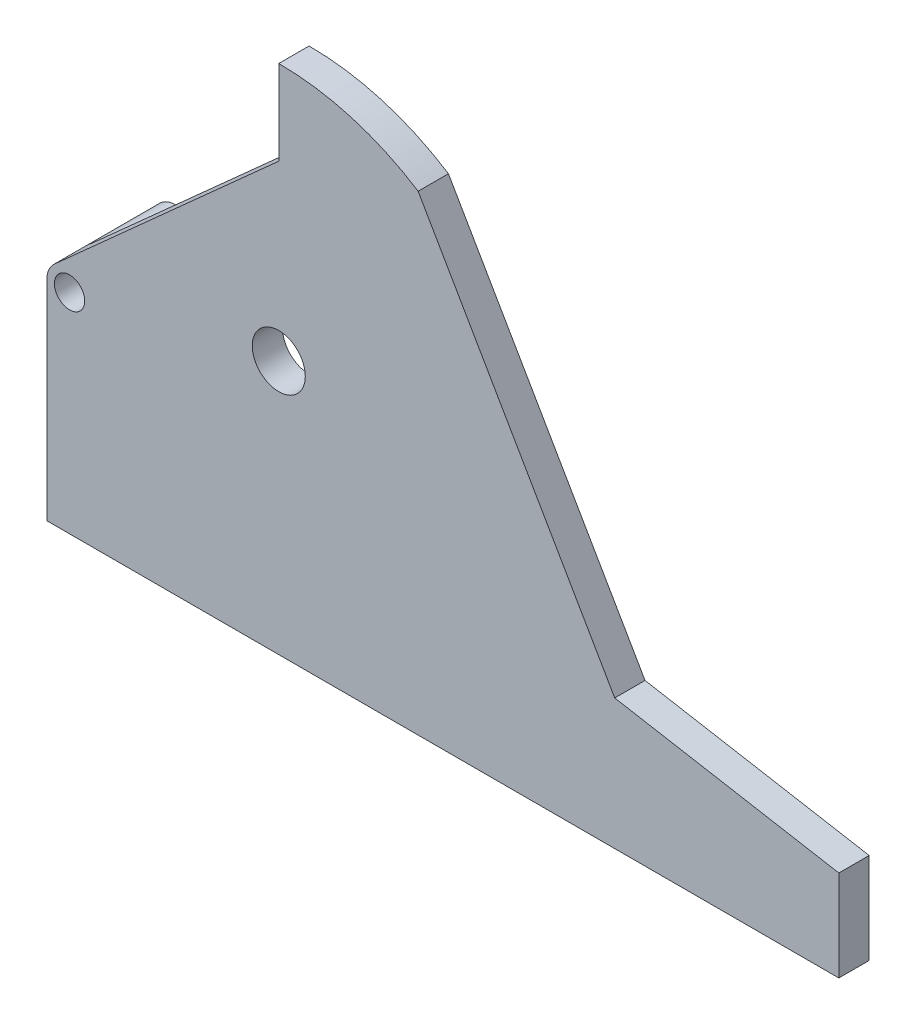
ISO-10303-21;
HEADER;
FILE_DESCRIPTION(('STEP AP214'),'2;1');
FILE_NAME('part.step','',(''),(''),'','','');
FILE_SCHEMA(('AUTOMOTIVE_DESIGN { 1 0 10303 214 1 1 1 1 }'));
ENDSEC;
DATA;
#1=APPLICATION_CONTEXT('core data for automotive mechanical design processes');
#2=APPLICATION_PROTOCOL_DEFINITION('international standard','automotive_design',2000,#1);
#3=PRODUCT_CONTEXT('',#1,'mechanical');
#4=PRODUCT('Part','Part','',(#3));
#5=PRODUCT_RELATED_PRODUCT_CATEGORY('part','',(#4));
#6=PRODUCT_DEFINITION_FORMATION('','',#4);
#7=PRODUCT_DEFINITION_CONTEXT('part definition',#1,'design');
#8=PRODUCT_DEFINITION('design','',#6,#7);
#9=PRODUCT_DEFINITION_SHAPE('','',#8);
#10=(LENGTH_UNIT() NAMED_UNIT(*) SI_UNIT(.MILLI.,.METRE.));
#11=(NAMED_UNIT(*) PLANE_ANGLE_UNIT() SI_UNIT($,.RADIAN.));
#12=(NAMED_UNIT(*) SI_UNIT($,.STERADIAN.) SOLID_ANGLE_UNIT());
#13=UNCERTAINTY_MEASURE_WITH_UNIT(LENGTH_MEASURE(1.E-05),#10,'distance_accuracy_value','');
#14=(GEOMETRIC_REPRESENTATION_CONTEXT(3) GLOBAL_UNCERTAINTY_ASSIGNED_CONTEXT((#13)) GLOBAL_UNIT_ASSIGNED_CONTEXT((#10,
#11,#12)) REPRESENTATION_CONTEXT('',''));
#15=CARTESIAN_POINT('',(0.,0.,0.));
#16=DIRECTION('',(0.,0.,1.));
#17=DIRECTION('',(1.,0.,0.));
#18=AXIS2_PLACEMENT_3D('',#15,#16,#17);
#19=CARTESIAN_POINT('',(153.,167.740187298071,20.));
#20=DIRECTION('',(0.,0.,-1.));
#21=DIRECTION('',(-1.,0.,0.));
#22=AXIS2_PLACEMENT_3D('',#19,#20,#21);
#23=CYLINDRICAL_SURFACE('',#22,170.);
#24=CARTESIAN_POINT('',(153.,167.740187298071,0.));
#25=DIRECTION('',(0.,0.,1.));
#26=DIRECTION('',(1.,0.,0.));
#27=AXIS2_PLACEMENT_3D('',#24,#25,#26);
#28=CIRCLE('',#27,170.);
#29=CARTESIAN_POINT('',(244.94,310.733321398979,0.));
#30=VERTEX_POINT('',#29);
#31=CARTESIAN_POINT('',(153.,337.740187298071,0.));
#32=VERTEX_POINT('',#31);
#33=EDGE_CURVE('E280',#30,#32,#28,.T.);
#34=ORIENTED_EDGE('',*,*,#33,.T.);
#35=DIRECTION('',(0.,0.,-1.));
#36=VECTOR('',#35,1.);
#37=CARTESIAN_POINT('',(153.,337.740187298071,20.));
#38=LINE('',#37,#36);
#39=CARTESIAN_POINT('',(153.,337.740187298071,20.));
#40=VERTEX_POINT('',#39);
#41=EDGE_CURVE('E118',#40,#32,#38,.T.);
#42=ORIENTED_EDGE('',*,*,#41,.F.);
#43=CARTESIAN_POINT('',(153.,167.740187298071,20.));
#44=DIRECTION('',(0.,0.,1.));
#45=DIRECTION('',(1.,0.,0.));
#46=AXIS2_PLACEMENT_3D('',#43,#44,#45);
#47=CIRCLE('',#46,170.);
#48=CARTESIAN_POINT('',(244.94,310.733321398979,20.));
#49=VERTEX_POINT('',#48);
#50=EDGE_CURVE('E259',#49,#40,#47,.T.);
#51=ORIENTED_EDGE('',*,*,#50,.F.);
#52=DIRECTION('',(0.,0.,-1.));
#53=VECTOR('',#52,1.);
#54=CARTESIAN_POINT('',(244.94,310.733321398979,20.));
#55=LINE('',#54,#53);
#56=EDGE_CURVE('E12',#49,#30,#55,.T.);
#57=ORIENTED_EDGE('',*,*,#56,.T.);
#58=EDGE_LOOP('',(#34,#42,#51,#57));
#59=FACE_BOUND('',#58,.T.);
#60=ADVANCED_FACE('F107',(#59),#23,.T.);
#61=CARTESIAN_POINT('',(153.,0.,20.));
#62=DIRECTION('',(-1.,0.,0.));
#63=DIRECTION('',(0.,0.,1.));
#64=AXIS2_PLACEMENT_3D('',#61,#62,#63);
#65=PLANE('',#64);
#66=DIRECTION('',(0.,1.,0.));
#67=VECTOR('',#66,1.);
#68=CARTESIAN_POINT('',(153.,0.,0.));
#69=LINE('',#68,#67);
#70=CARTESIAN_POINT('',(153.,281.918848090833,0.));
#71=VERTEX_POINT('',#70);
#72=EDGE_CURVE('E284',#71,#32,#69,.T.);
#73=ORIENTED_EDGE('',*,*,#72,.F.);
#74=DIRECTION('',(0.,0.,-1.));
#75=VECTOR('',#74,1.);
#76=CARTESIAN_POINT('',(153.,281.918848090833,20.));
#77=LINE('',#76,#75);
#78=CARTESIAN_POINT('',(153.,281.918848090833,20.));
#79=VERTEX_POINT('',#78);
#80=EDGE_CURVE('E228',#79,#71,#77,.T.);
#81=ORIENTED_EDGE('',*,*,#80,.F.);
#82=DIRECTION('',(0.,1.,0.));
#83=VECTOR('',#82,1.);
#84=CARTESIAN_POINT('',(153.,0.,20.));
#85=LINE('',#84,#83);
#86=EDGE_CURVE('E262',#79,#40,#85,.T.);
#87=ORIENTED_EDGE('',*,*,#86,.T.);
#88=ORIENTED_EDGE('',*,*,#41,.T.);
#89=EDGE_LOOP('',(#73,#81,#87,#88));
#90=FACE_BOUND('',#89,.T.);
#91=ADVANCED_FACE('F318',(#90),#65,.T.);
#92=CARTESIAN_POINT('',(-71.9216253841728,80.190761516644,20.));
#93=DIRECTION('',(-0.66768118292682,0.744447337268019,0.));
#94=DIRECTION('',(-0.744447337268019,-0.66768118292682,0.));
#95=AXIS2_PLACEMENT_3D('',#92,#93,#94);
#96=PLANE('',#95);
#97=DIRECTION('',(0.744447337268019,0.66768118292682,0.));
#98=VECTOR('',#97,1.);
#99=CARTESIAN_POINT('',(-71.9216253841728,80.190761516644,0.));
#100=LINE('',#99,#98);
#101=CARTESIAN_POINT('',(4.98478225609769,149.16671005902,0.));
#102=VERTEX_POINT('',#101);
#103=EDGE_CURVE('E288',#102,#71,#100,.T.);
#104=ORIENTED_EDGE('',*,*,#103,.F.);
#105=DIRECTION('',(0.,0.,-1.));
#106=VECTOR('',#105,1.);
#107=CARTESIAN_POINT('',(4.98478225609769,149.16671005902,20.));
#108=LINE('',#107,#106);
#109=CARTESIAN_POINT('',(4.98478225609769,149.16671005902,20.));
#110=VERTEX_POINT('',#109);
#111=EDGE_CURVE('E224',#110,#102,#108,.T.);
#112=ORIENTED_EDGE('',*,*,#111,.F.);
#113=DIRECTION('',(0.744447337268019,0.66768118292682,0.));
#114=VECTOR('',#113,1.);
#115=CARTESIAN_POINT('',(-71.9216253841728,80.190761516644,20.));
#116=LINE('',#115,#114);
#117=EDGE_CURVE('E266',#110,#79,#116,.T.);
#118=ORIENTED_EDGE('',*,*,#117,.T.);
#119=ORIENTED_EDGE('',*,*,#80,.T.);
#120=EDGE_LOOP('',(#104,#112,#118,#119));
#121=FACE_BOUND('',#120,.T.);
#122=ADVANCED_FACE('F323',(#121),#96,.T.);
#123=CARTESIAN_POINT('',(0.,0.,20.));
#124=DIRECTION('',(-1.,0.,0.));
#125=DIRECTION('',(0.,0.,1.));
#126=AXIS2_PLACEMENT_3D('',#123,#124,#125);
#127=PLANE('',#126);
#128=DIRECTION('',(0.,1.,0.));
#129=VECTOR('',#128,1.);
#130=CARTESIAN_POINT('',(0.,0.,0.));
#131=LINE('',#130,#129);
#132=CARTESIAN_POINT('',(0.,0.,0.));
#133=VERTEX_POINT('',#132);
#134=CARTESIAN_POINT('',(0.,138.,0.));
#135=VERTEX_POINT('',#134);
#136=EDGE_CURVE('E291',#133,#135,#131,.T.);
#137=ORIENTED_EDGE('',*,*,#136,.F.);
#138=DIRECTION('',(0.,0.,-1.));
#139=VECTOR('',#138,1.);
#140=CARTESIAN_POINT('',(0.,0.,20.));
#141=LINE('',#140,#139);
#142=CARTESIAN_POINT('',(0.,0.,20.));
#143=VERTEX_POINT('',#142);
#144=EDGE_CURVE('E212',#143,#133,#141,.T.);
#145=ORIENTED_EDGE('',*,*,#144,.F.);
#146=DIRECTION('',(0.,1.,0.));
#147=VECTOR('',#146,1.);
#148=CARTESIAN_POINT('',(0.,0.,20.));
#149=LINE('',#148,#147);
#150=CARTESIAN_POINT('',(0.,138.,20.));
#151=VERTEX_POINT('',#150);
#152=EDGE_CURVE('E204',#143,#151,#149,.T.);
#153=ORIENTED_EDGE('',*,*,#152,.T.);
#154=DIRECTION('',(0.,0.,-1.));
#155=VECTOR('',#154,1.);
#156=CARTESIAN_POINT('',(0.,138.,20.));
#157=LINE('',#156,#155);
#158=EDGE_CURVE('E216',#151,#135,#157,.T.);
#159=ORIENTED_EDGE('',*,*,#158,.T.);
#160=EDGE_LOOP('',(#137,#145,#153,#159));
#161=FACE_BOUND('',#160,.T.);
#162=ADVANCED_FACE('F329',(#161),#127,.T.);
#163=CARTESIAN_POINT('',(0.,0.,20.));
#164=DIRECTION('',(0.,1.,0.));
#165=DIRECTION('',(0.,0.,1.));
#166=AXIS2_PLACEMENT_3D('',#163,#164,#165);
#167=PLANE('',#166);
#168=DIRECTION('',(1.,0.,0.));
#169=VECTOR('',#168,1.);
#170=CARTESIAN_POINT('',(0.,0.,0.));
#171=LINE('',#170,#169);
#172=CARTESIAN_POINT('',(522.5,0.,0.));
#173=VERTEX_POINT('',#172);
#174=EDGE_CURVE('E210',#133,#173,#171,.T.);
#175=ORIENTED_EDGE('',*,*,#174,.T.);
#176=DIRECTION('',(0.,0.,-1.));
#177=VECTOR('',#176,1.);
#178=CARTESIAN_POINT('',(522.5,0.,20.));
#179=LINE('',#178,#177);
#180=CARTESIAN_POINT('',(522.5,0.,20.));
#181=VERTEX_POINT('',#180);
#182=EDGE_CURVE('E191',#181,#173,#179,.T.);
#183=ORIENTED_EDGE('',*,*,#182,.F.);
#184=DIRECTION('',(1.,0.,0.));
#185=VECTOR('',#184,1.);
#186=CARTESIAN_POINT('',(0.,0.,20.));
#187=LINE('',#186,#185);
#188=EDGE_CURVE('E195',#143,#181,#187,.T.);
#189=ORIENTED_EDGE('',*,*,#188,.F.);
#190=ORIENTED_EDGE('',*,*,#144,.T.);
#191=EDGE_LOOP('',(#175,#183,#189,#190));
#192=FACE_BOUND('',#191,.T.);
#193=ADVANCED_FACE('F208',(#192),#167,.F.);
#194=CARTESIAN_POINT('',(522.5,0.,20.));
#195=DIRECTION('',(-1.,0.,0.));
#196=DIRECTION('',(0.,0.,1.));
#197=AXIS2_PLACEMENT_3D('',#194,#195,#196);
#198=PLANE('',#197);
#199=DIRECTION('',(0.,1.,0.));
#200=VECTOR('',#199,1.);
#201=CARTESIAN_POINT('',(522.5,0.,0.));
#202=LINE('',#201,#200);
#203=CARTESIAN_POINT('',(522.5,60.,0.));
#204=VERTEX_POINT('',#203);
#205=EDGE_CURVE('E296',#173,#204,#202,.T.);
#206=ORIENTED_EDGE('',*,*,#205,.T.);
#207=DIRECTION('',(0.,0.,-1.));
#208=VECTOR('',#207,1.);
#209=CARTESIAN_POINT('',(522.5,60.,20.));
#210=LINE('',#209,#208);
#211=CARTESIAN_POINT('',(522.5,60.,20.));
#212=VERTEX_POINT('',#211);
#213=EDGE_CURVE('E193',#212,#204,#210,.T.);
#214=ORIENTED_EDGE('',*,*,#213,.F.);
#215=DIRECTION('',(0.,1.,0.));
#216=VECTOR('',#215,1.);
#217=CARTESIAN_POINT('',(522.5,0.,20.));
#218=LINE('',#217,#216);
#219=EDGE_CURVE('E186',#181,#212,#218,.T.);
#220=ORIENTED_EDGE('',*,*,#219,.F.);
#221=ORIENTED_EDGE('',*,*,#182,.T.);
#222=EDGE_LOOP('',(#206,#214,#220,#221));
#223=FACE_BOUND('',#222,.T.);
#224=ADVANCED_FACE('F189',(#223),#198,.F.);
#225=CARTESIAN_POINT('',(26.0159071194517,147.543541067409,20.));
#226=DIRECTION('',(-0.173648177666931,-0.984807753012208,0.));
#227=DIRECTION('',(0.984807753012208,-0.173648177666931,0.));
#228=AXIS2_PLACEMENT_3D('',#225,#226,#227);
#229=PLANE('',#228);
#230=DIRECTION('',(-0.984807753012208,0.173648177666931,0.));
#231=VECTOR('',#230,1.);
#232=CARTESIAN_POINT('',(26.0159071194517,147.543541067409,0.));
#233=LINE('',#232,#231);
#234=CARTESIAN_POINT('',(374.649400312245,86.0700498388778,0.));
#235=VERTEX_POINT('',#234);
#236=EDGE_CURVE('E155',#204,#235,#233,.T.);
#237=ORIENTED_EDGE('',*,*,#236,.T.);
#238=DIRECTION('',(0.,0.,-1.));
#239=VECTOR('',#238,1.);
#240=CARTESIAN_POINT('',(374.649400312245,86.0700498388778,20.));
#241=LINE('',#240,#239);
#242=CARTESIAN_POINT('',(374.649400312245,86.0700498388778,20.));
#243=VERTEX_POINT('',#242);
#244=EDGE_CURVE('E162',#243,#235,#241,.T.);
#245=ORIENTED_EDGE('',*,*,#244,.F.);
#246=DIRECTION('',(-0.984807753012208,0.173648177666931,0.));
#247=VECTOR('',#246,1.);
#248=CARTESIAN_POINT('',(26.0159071194517,147.543541067409,20.));
#249=LINE('',#248,#247);
#250=EDGE_CURVE('E127',#212,#243,#249,.T.);
#251=ORIENTED_EDGE('',*,*,#250,.F.);
#252=ORIENTED_EDGE('',*,*,#213,.T.);
#253=EDGE_LOOP('',(#237,#245,#251,#252));
#254=FACE_BOUND('',#253,.T.);
#255=ADVANCED_FACE('F302',(#254),#229,.F.);
#256=CARTESIAN_POINT('',(318.256475066915,183.745461551224,20.));
#257=DIRECTION('',(0.86602540378444,0.499999999999998,0.));
#258=DIRECTION('',(-0.499999999999998,0.86602540378444,0.));
#259=AXIS2_PLACEMENT_3D('',#256,#257,#258);
#260=PLANE('',#259);
#261=DIRECTION('',(0.499999999999998,-0.86602540378444,0.));
#262=VECTOR('',#261,1.);
#263=CARTESIAN_POINT('',(318.256475066915,183.745461551224,0.));
#264=LINE('',#263,#262);
#265=EDGE_CURVE('E277',#30,#235,#264,.T.);
#266=ORIENTED_EDGE('',*,*,#265,.F.);
#267=ORIENTED_EDGE('',*,*,#56,.F.);
#268=DIRECTION('',(0.499999999999998,-0.86602540378444,0.));
#269=VECTOR('',#268,1.);
#270=CARTESIAN_POINT('',(318.256475066915,183.745461551224,20.));
#271=LINE('',#270,#269);
#272=EDGE_CURVE('E256',#49,#243,#271,.T.);
#273=ORIENTED_EDGE('',*,*,#272,.T.);
#274=ORIENTED_EDGE('',*,*,#244,.T.);
#275=EDGE_LOOP('',(#266,#267,#273,#274));
#276=FACE_BOUND('',#275,.T.);
#277=ADVANCED_FACE('F305',(#276),#260,.T.);
#278=CARTESIAN_POINT('',(153.,167.740187298071,20.));
#279=DIRECTION('',(0.,0.,-1.));
#280=DIRECTION('',(-1.,0.,0.));
#281=AXIS2_PLACEMENT_3D('',#278,#279,#280);
#282=CYLINDRICAL_SURFACE('',#281,17.5);
#283=CARTESIAN_POINT('',(153.,167.740187298071,20.));
#284=DIRECTION('',(0.,0.,1.));
#285=DIRECTION('',(1.,0.,0.));
#286=AXIS2_PLACEMENT_3D('',#283,#284,#285);
#287=CIRCLE('',#286,17.5);
#288=CARTESIAN_POINT('',(170.5,167.740187298071,20.));
#289=VERTEX_POINT('',#288);
#290=EDGE_CURVE('E252',#289,#289,#287,.T.);
#291=ORIENTED_EDGE('',*,*,#290,.T.);
#292=EDGE_LOOP('',(#291));
#293=FACE_BOUND('',#292,.T.);
#294=CARTESIAN_POINT('',(153.,167.740187298071,0.));
#295=DIRECTION('',(0.,0.,1.));
#296=DIRECTION('',(1.,0.,0.));
#297=AXIS2_PLACEMENT_3D('',#294,#295,#296);
#298=CIRCLE('',#297,17.5);
#299=CARTESIAN_POINT('',(170.5,167.740187298071,0.));
#300=VERTEX_POINT('',#299);
#301=EDGE_CURVE('E240',#300,#300,#298,.T.);
#302=ORIENTED_EDGE('',*,*,#301,.F.);
#303=EDGE_LOOP('',(#302));
#304=FACE_BOUND('',#303,.T.);
#305=ADVANCED_FACE('F307',(#293,#304),#282,.F.);
#306=CARTESIAN_POINT('',(0.,0.,0.));
#307=DIRECTION('',(0.,0.,1.));
#308=DIRECTION('',(1.,0.,0.));
#309=AXIS2_PLACEMENT_3D('',#306,#307,#308);
#310=PLANE('',#309);
#311=ORIENTED_EDGE('',*,*,#301,.T.);
#312=EDGE_LOOP('',(#311));
#313=FACE_BOUND('',#312,.T.);
#314=ORIENTED_EDGE('',*,*,#136,.T.);
#315=CARTESIAN_POINT('',(15.,138.,0.));
#316=DIRECTION('',(0.,0.,1.));
#317=DIRECTION('',(1.,0.,0.));
#318=AXIS2_PLACEMENT_3D('',#315,#316,#317);
#319=CIRCLE('',#318,15.);
#320=EDGE_CURVE('E235',#135,#102,#319,.T.);
#321=ORIENTED_EDGE('',*,*,#320,.T.);
#322=ORIENTED_EDGE('',*,*,#103,.T.);
#323=ORIENTED_EDGE('',*,*,#72,.T.);
#324=ORIENTED_EDGE('',*,*,#33,.F.);
#325=ORIENTED_EDGE('',*,*,#265,.T.);
#326=ORIENTED_EDGE('',*,*,#236,.F.);
#327=ORIENTED_EDGE('',*,*,#205,.F.);
#328=ORIENTED_EDGE('',*,*,#174,.F.);
#329=EDGE_LOOP('',(#314,#321,#322,#323,#324,#325,#326,#327,#328));
#330=FACE_BOUND('',#329,.T.);
#331=ADVANCED_FACE('F304',(#313,#330),#310,.F.);
#332=CARTESIAN_POINT('',(0.,0.,20.));
#333=DIRECTION('',(0.,0.,1.));
#334=DIRECTION('',(1.,0.,0.));
#335=AXIS2_PLACEMENT_3D('',#332,#333,#334);
#336=PLANE('',#335);
#337=ORIENTED_EDGE('',*,*,#117,.F.);
#338=CARTESIAN_POINT('',(15.,138.,20.));
#339=DIRECTION('',(0.,0.,1.));
#340=DIRECTION('',(1.,0.,0.));
#341=AXIS2_PLACEMENT_3D('',#338,#339,#340);
#342=CIRCLE('',#341,15.);
#343=EDGE_CURVE('E111',#110,#151,#342,.T.);
#344=ORIENTED_EDGE('',*,*,#343,.T.);
#345=ORIENTED_EDGE('',*,*,#152,.F.);
#346=ORIENTED_EDGE('',*,*,#188,.T.);
#347=ORIENTED_EDGE('',*,*,#219,.T.);
#348=ORIENTED_EDGE('',*,*,#250,.T.);
#349=ORIENTED_EDGE('',*,*,#272,.F.);
#350=ORIENTED_EDGE('',*,*,#50,.T.);
#351=ORIENTED_EDGE('',*,*,#86,.F.);
#352=EDGE_LOOP('',(#337,#344,#345,#346,#347,#348,#349,#350,#351));
#353=FACE_BOUND('',#352,.T.);
#354=ORIENTED_EDGE('',*,*,#290,.F.);
#355=EDGE_LOOP('',(#354));
#356=FACE_BOUND('',#355,.T.);
#357=CARTESIAN_POINT('',(15.,138.,20.));
#358=DIRECTION('',(0.,0.,1.));
#359=DIRECTION('',(1.,0.,0.));
#360=AXIS2_PLACEMENT_3D('',#357,#358,#359);
#361=CIRCLE('',#360,10.);
#362=CARTESIAN_POINT('',(25.,138.,20.));
#363=VERTEX_POINT('',#362);
#364=EDGE_CURVE('E232',#363,#363,#361,.T.);
#365=ORIENTED_EDGE('',*,*,#364,.F.);
#366=EDGE_LOOP('',(#365));
#367=FACE_BOUND('',#366,.T.);
#368=ADVANCED_FACE('F200',(#353,#356,#367),#336,.T.);
#369=CARTESIAN_POINT('',(15.,138.,20.));
#370=DIRECTION('',(0.,0.,-1.));
#371=DIRECTION('',(-1.,0.,0.));
#372=AXIS2_PLACEMENT_3D('',#369,#370,#371);
#373=CYLINDRICAL_SURFACE('',#372,10.);
#374=ORIENTED_EDGE('',*,*,#364,.T.);
#375=EDGE_LOOP('',(#374));
#376=FACE_BOUND('',#375,.T.);
#377=CARTESIAN_POINT('',(15.,138.,-50.));
#378=DIRECTION('',(0.,0.,1.));
#379=DIRECTION('',(1.,0.,0.));
#380=AXIS2_PLACEMENT_3D('',#377,#378,#379);
#381=CIRCLE('',#380,10.);
#382=CARTESIAN_POINT('',(25.,138.,-50.));
#383=VERTEX_POINT('',#382);
#384=EDGE_CURVE('E248',#383,#383,#381,.T.);
#385=ORIENTED_EDGE('',*,*,#384,.F.);
#386=EDGE_LOOP('',(#385));
#387=FACE_BOUND('',#386,.T.);
#388=ADVANCED_FACE('F343',(#376,#387),#373,.F.);
#389=CARTESIAN_POINT('',(15.,138.,20.));
#390=DIRECTION('',(0.,0.,-1.));
#391=DIRECTION('',(-1.,0.,0.));
#392=AXIS2_PLACEMENT_3D('',#389,#390,#391);
#393=CYLINDRICAL_SURFACE('',#392,15.);
#394=ORIENTED_EDGE('',*,*,#111,.T.);
#395=ORIENTED_EDGE('',*,*,#320,.F.);
#396=ORIENTED_EDGE('',*,*,#158,.F.);
#397=ORIENTED_EDGE('',*,*,#343,.F.);
#398=EDGE_LOOP('',(#394,#395,#396,#397));
#399=FACE_BOUND('',#398,.T.);
#400=CARTESIAN_POINT('',(15.,138.,-50.));
#401=DIRECTION('',(0.,0.,1.));
#402=DIRECTION('',(1.,0.,0.));
#403=AXIS2_PLACEMENT_3D('',#400,#401,#402);
#404=CIRCLE('',#403,15.);
#405=CARTESIAN_POINT('',(30.,138.,-50.));
#406=VERTEX_POINT('',#405);
#407=EDGE_CURVE('E241',#406,#406,#404,.T.);
#408=ORIENTED_EDGE('',*,*,#407,.T.);
#409=EDGE_LOOP('',(#408));
#410=FACE_BOUND('',#409,.T.);
#411=ADVANCED_FACE('F109',(#399,#410),#393,.T.);
#412=CARTESIAN_POINT('',(15.,138.,-50.));
#413=DIRECTION('',(0.,0.,1.));
#414=DIRECTION('',(1.,0.,0.));
#415=AXIS2_PLACEMENT_3D('',#412,#413,#414);
#416=PLANE('',#415);
#417=ORIENTED_EDGE('',*,*,#384,.T.);
#418=EDGE_LOOP('',(#417));
#419=FACE_BOUND('',#418,.T.);
#420=ORIENTED_EDGE('',*,*,#407,.F.);
#421=EDGE_LOOP('',(#420));
#422=FACE_BOUND('',#421,.T.);
#423=ADVANCED_FACE('F344',(#419,#422),#416,.F.);
#424=CLOSED_SHELL('',(#60,#91,#122,#162,#193,#224,#255,#277,#305,#331,#368,#388,#411,#423));
#425=MANIFOLD_SOLID_BREP('B2',#424);
#426=ADVANCED_BREP_SHAPE_REPRESENTATION('',(#18,#425),#14);
#427=SHAPE_DEFINITION_REPRESENTATION(#9,#426);
ENDSEC;
END-ISO-10303-21;
